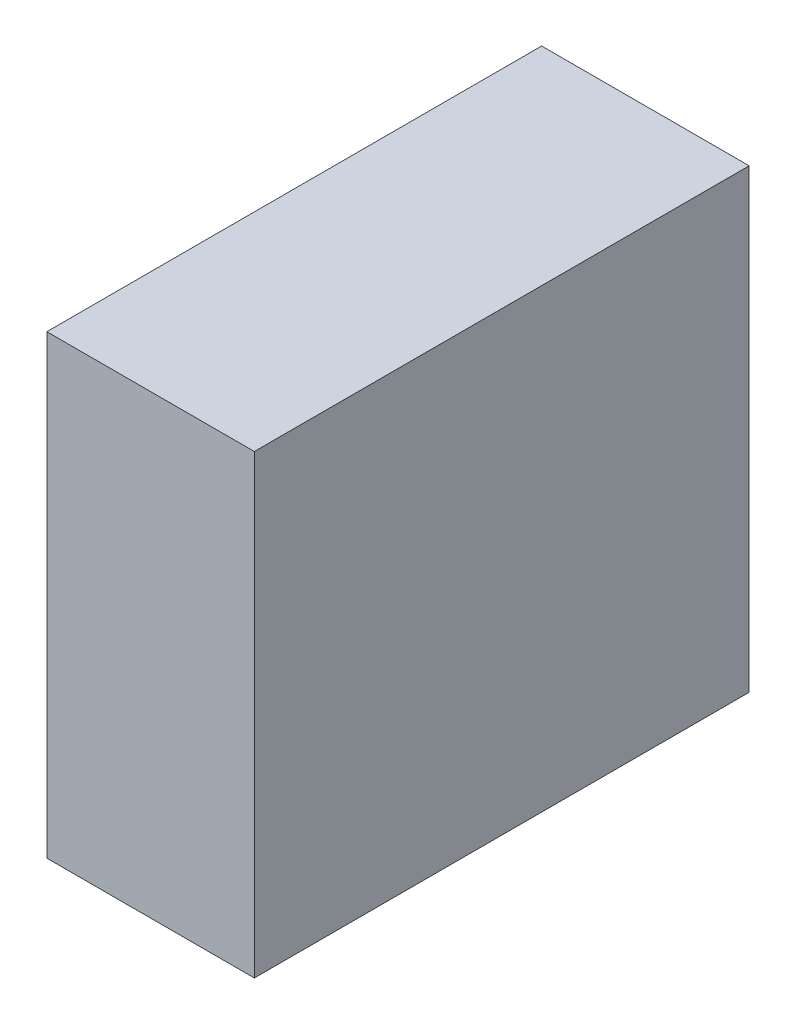
ISO-10303-21;
HEADER;
FILE_DESCRIPTION(('STEP AP214'),'2;1');
FILE_NAME('part.step','',(''),(''),'','','');
FILE_SCHEMA(('AUTOMOTIVE_DESIGN { 1 0 10303 214 1 1 1 1 }'));
ENDSEC;
DATA;
#1=APPLICATION_CONTEXT('core data for automotive mechanical design processes');
#2=APPLICATION_PROTOCOL_DEFINITION('international standard','automotive_design',2000,#1);
#3=PRODUCT_CONTEXT('',#1,'mechanical');
#4=PRODUCT('Part','Part','',(#3));
#5=PRODUCT_RELATED_PRODUCT_CATEGORY('part','',(#4));
#6=PRODUCT_DEFINITION_FORMATION('','',#4);
#7=PRODUCT_DEFINITION_CONTEXT('part definition',#1,'design');
#8=PRODUCT_DEFINITION('design','',#6,#7);
#9=PRODUCT_DEFINITION_SHAPE('','',#8);
#10=(LENGTH_UNIT() NAMED_UNIT(*) SI_UNIT(.MILLI.,.METRE.));
#11=(NAMED_UNIT(*) PLANE_ANGLE_UNIT() SI_UNIT($,.RADIAN.));
#12=(NAMED_UNIT(*) SI_UNIT($,.STERADIAN.) SOLID_ANGLE_UNIT());
#13=UNCERTAINTY_MEASURE_WITH_UNIT(LENGTH_MEASURE(1.E-05),#10,'distance_accuracy_value','');
#14=(GEOMETRIC_REPRESENTATION_CONTEXT(3) GLOBAL_UNCERTAINTY_ASSIGNED_CONTEXT((#13)) GLOBAL_UNIT_ASSIGNED_CONTEXT((#10,
#11,#12)) REPRESENTATION_CONTEXT('',''));
#15=CARTESIAN_POINT('',(0.,0.,0.));
#16=DIRECTION('',(0.,0.,1.));
#17=DIRECTION('',(1.,0.,0.));
#18=AXIS2_PLACEMENT_3D('',#15,#16,#17);
#19=CARTESIAN_POINT('',(0.,166.878,0.));
#20=DIRECTION('',(1.,0.,0.));
#21=DIRECTION('',(0.,0.,-1.));
#22=AXIS2_PLACEMENT_3D('',#19,#20,#21);
#23=PLANE('',#22);
#24=DIRECTION('',(0.,0.,1.));
#25=VECTOR('',#24,1.);
#26=CARTESIAN_POINT('',(0.,0.,0.));
#27=LINE('',#26,#25);
#28=CARTESIAN_POINT('',(0.,0.,-181.102));
#29=VERTEX_POINT('',#28);
#30=CARTESIAN_POINT('',(0.,0.,0.));
#31=VERTEX_POINT('',#30);
#32=EDGE_CURVE('E98',#29,#31,#27,.T.);
#33=ORIENTED_EDGE('',*,*,#32,.T.);
#34=DIRECTION('',(0.,-1.,0.));
#35=VECTOR('',#34,1.);
#36=CARTESIAN_POINT('',(0.,166.878,0.));
#37=LINE('',#36,#35);
#38=CARTESIAN_POINT('',(0.,166.878,0.));
#39=VERTEX_POINT('',#38);
#40=EDGE_CURVE('E11',#39,#31,#37,.T.);
#41=ORIENTED_EDGE('',*,*,#40,.F.);
#42=DIRECTION('',(0.,0.,1.));
#43=VECTOR('',#42,1.);
#44=CARTESIAN_POINT('',(0.,166.878,0.));
#45=LINE('',#44,#43);
#46=CARTESIAN_POINT('',(0.,166.878,-181.102));
#47=VERTEX_POINT('',#46);
#48=EDGE_CURVE('E86',#47,#39,#45,.T.);
#49=ORIENTED_EDGE('',*,*,#48,.F.);
#50=DIRECTION('',(0.,-1.,0.));
#51=VECTOR('',#50,1.);
#52=CARTESIAN_POINT('',(0.,166.878,-181.102));
#53=LINE('',#52,#51);
#54=EDGE_CURVE('E94',#47,#29,#53,.T.);
#55=ORIENTED_EDGE('',*,*,#54,.T.);
#56=EDGE_LOOP('',(#33,#41,#49,#55));
#57=FACE_BOUND('',#56,.T.);
#58=ADVANCED_FACE('F35',(#57),#23,.F.);
#59=CARTESIAN_POINT('',(0.,166.878,0.));
#60=DIRECTION('',(0.,0.,-1.));
#61=DIRECTION('',(-1.,0.,0.));
#62=AXIS2_PLACEMENT_3D('',#59,#60,#61);
#63=PLANE('',#62);
#64=DIRECTION('',(1.,0.,0.));
#65=VECTOR('',#64,1.);
#66=CARTESIAN_POINT('',(0.,0.,0.));
#67=LINE('',#66,#65);
#68=CARTESIAN_POINT('',(75.946,0.,0.));
#69=VERTEX_POINT('',#68);
#70=EDGE_CURVE('E90',#31,#69,#67,.T.);
#71=ORIENTED_EDGE('',*,*,#70,.T.);
#72=DIRECTION('',(0.,-1.,0.));
#73=VECTOR('',#72,1.);
#74=CARTESIAN_POINT('',(75.946,166.878,0.));
#75=LINE('',#74,#73);
#76=CARTESIAN_POINT('',(75.946,166.878,0.));
#77=VERTEX_POINT('',#76);
#78=EDGE_CURVE('E43',#77,#69,#75,.T.);
#79=ORIENTED_EDGE('',*,*,#78,.F.);
#80=DIRECTION('',(1.,0.,0.));
#81=VECTOR('',#80,1.);
#82=CARTESIAN_POINT('',(0.,166.878,0.));
#83=LINE('',#82,#81);
#84=EDGE_CURVE('E81',#39,#77,#83,.T.);
#85=ORIENTED_EDGE('',*,*,#84,.F.);
#86=ORIENTED_EDGE('',*,*,#40,.T.);
#87=EDGE_LOOP('',(#71,#79,#85,#86));
#88=FACE_BOUND('',#87,.T.);
#89=ADVANCED_FACE('F89',(#88),#63,.F.);
#90=CARTESIAN_POINT('',(75.946,166.878,0.));
#91=DIRECTION('',(-1.,0.,0.));
#92=DIRECTION('',(0.,0.,1.));
#93=AXIS2_PLACEMENT_3D('',#90,#91,#92);
#94=PLANE('',#93);
#95=DIRECTION('',(0.,0.,-1.));
#96=VECTOR('',#95,1.);
#97=CARTESIAN_POINT('',(75.946,0.,0.));
#98=LINE('',#97,#96);
#99=CARTESIAN_POINT('',(75.946,0.,-181.102));
#100=VERTEX_POINT('',#99);
#101=EDGE_CURVE('E68',#69,#100,#98,.T.);
#102=ORIENTED_EDGE('',*,*,#101,.T.);
#103=DIRECTION('',(0.,-1.,0.));
#104=VECTOR('',#103,1.);
#105=CARTESIAN_POINT('',(75.946,166.878,-181.102));
#106=LINE('',#105,#104);
#107=CARTESIAN_POINT('',(75.946,166.878,-181.102));
#108=VERTEX_POINT('',#107);
#109=EDGE_CURVE('E91',#108,#100,#106,.T.);
#110=ORIENTED_EDGE('',*,*,#109,.F.);
#111=DIRECTION('',(0.,0.,-1.));
#112=VECTOR('',#111,1.);
#113=CARTESIAN_POINT('',(75.946,166.878,0.));
#114=LINE('',#113,#112);
#115=EDGE_CURVE('E84',#77,#108,#114,.T.);
#116=ORIENTED_EDGE('',*,*,#115,.F.);
#117=ORIENTED_EDGE('',*,*,#78,.T.);
#118=EDGE_LOOP('',(#102,#110,#116,#117));
#119=FACE_BOUND('',#118,.T.);
#120=ADVANCED_FACE('F92',(#119),#94,.F.);
#121=CARTESIAN_POINT('',(0.,166.878,-181.102));
#122=DIRECTION('',(0.,0.,1.));
#123=DIRECTION('',(1.,0.,0.));
#124=AXIS2_PLACEMENT_3D('',#121,#122,#123);
#125=PLANE('',#124);
#126=DIRECTION('',(-1.,0.,0.));
#127=VECTOR('',#126,1.);
#128=CARTESIAN_POINT('',(0.,0.,-181.102));
#129=LINE('',#128,#127);
#130=EDGE_CURVE('E74',#100,#29,#129,.T.);
#131=ORIENTED_EDGE('',*,*,#130,.T.);
#132=ORIENTED_EDGE('',*,*,#54,.F.);
#133=DIRECTION('',(-1.,0.,0.));
#134=VECTOR('',#133,1.);
#135=CARTESIAN_POINT('',(0.,166.878,-181.102));
#136=LINE('',#135,#134);
#137=EDGE_CURVE('E51',#108,#47,#136,.T.);
#138=ORIENTED_EDGE('',*,*,#137,.F.);
#139=ORIENTED_EDGE('',*,*,#109,.T.);
#140=EDGE_LOOP('',(#131,#132,#138,#139));
#141=FACE_BOUND('',#140,.T.);
#142=ADVANCED_FACE('F105',(#141),#125,.F.);
#143=CARTESIAN_POINT('',(0.,166.878,0.));
#144=DIRECTION('',(0.,-1.,0.));
#145=DIRECTION('',(0.,0.,-1.));
#146=AXIS2_PLACEMENT_3D('',#143,#144,#145);
#147=PLANE('',#146);
#148=ORIENTED_EDGE('',*,*,#48,.T.);
#149=ORIENTED_EDGE('',*,*,#84,.T.);
#150=ORIENTED_EDGE('',*,*,#115,.T.);
#151=ORIENTED_EDGE('',*,*,#137,.T.);
#152=EDGE_LOOP('',(#148,#149,#150,#151));
#153=FACE_BOUND('',#152,.T.);
#154=ADVANCED_FACE('F82',(#153),#147,.F.);
#155=CARTESIAN_POINT('',(0.,0.,0.));
#156=DIRECTION('',(0.,-1.,0.));
#157=DIRECTION('',(0.,0.,-1.));
#158=AXIS2_PLACEMENT_3D('',#155,#156,#157);
#159=PLANE('',#158);
#160=ORIENTED_EDGE('',*,*,#32,.F.);
#161=ORIENTED_EDGE('',*,*,#130,.F.);
#162=ORIENTED_EDGE('',*,*,#101,.F.);
#163=ORIENTED_EDGE('',*,*,#70,.F.);
#164=EDGE_LOOP('',(#160,#161,#162,#163));
#165=FACE_BOUND('',#164,.T.);
#166=ADVANCED_FACE('F108',(#165),#159,.T.);
#167=CLOSED_SHELL('',(#58,#89,#120,#142,#154,#166));
#168=MANIFOLD_SOLID_BREP('B2',#167);
#169=ADVANCED_BREP_SHAPE_REPRESENTATION('',(#18,#168),#14);
#170=SHAPE_DEFINITION_REPRESENTATION(#9,#169);
ENDSEC;
END-ISO-10303-21;
